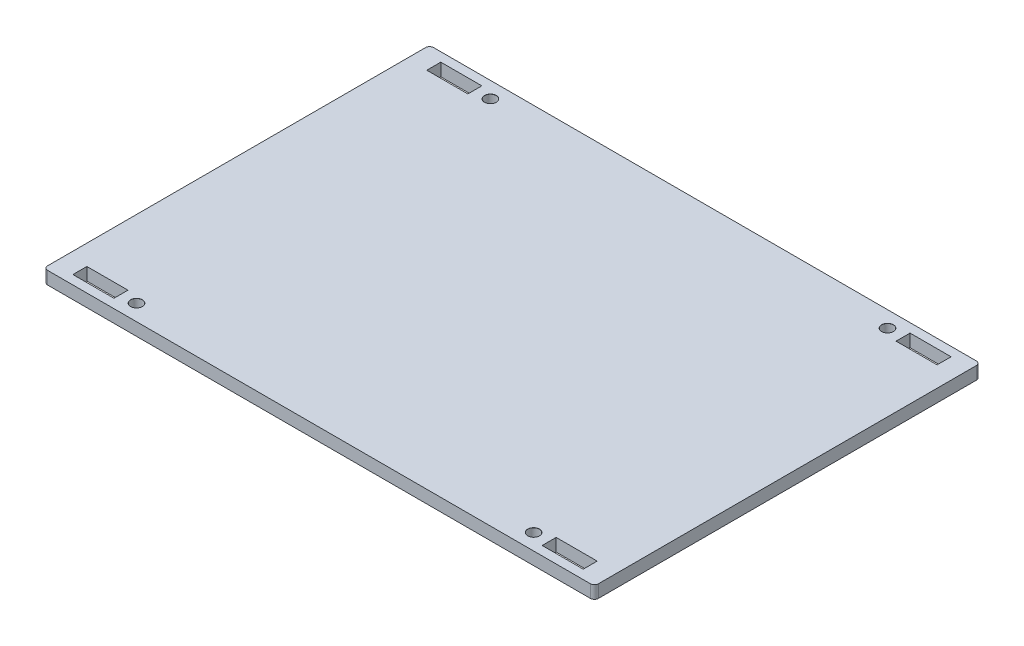
ISO-10303-21;
HEADER;
FILE_DESCRIPTION(('STEP AP214'),'2;1');
FILE_NAME('part.step','',(''),(''),'','','');
FILE_SCHEMA(('AUTOMOTIVE_DESIGN { 1 0 10303 214 1 1 1 1 }'));
ENDSEC;
DATA;
#1=APPLICATION_CONTEXT('core data for automotive mechanical design processes');
#2=APPLICATION_PROTOCOL_DEFINITION('international standard','automotive_design',2000,#1);
#3=PRODUCT_CONTEXT('',#1,'mechanical');
#4=PRODUCT('Part','Part','',(#3));
#5=PRODUCT_RELATED_PRODUCT_CATEGORY('part','',(#4));
#6=PRODUCT_DEFINITION_FORMATION('','',#4);
#7=PRODUCT_DEFINITION_CONTEXT('part definition',#1,'design');
#8=PRODUCT_DEFINITION('design','',#6,#7);
#9=PRODUCT_DEFINITION_SHAPE('','',#8);
#10=(LENGTH_UNIT() NAMED_UNIT(*) SI_UNIT(.MILLI.,.METRE.));
#11=(NAMED_UNIT(*) PLANE_ANGLE_UNIT() SI_UNIT($,.RADIAN.));
#12=(NAMED_UNIT(*) SI_UNIT($,.STERADIAN.) SOLID_ANGLE_UNIT());
#13=UNCERTAINTY_MEASURE_WITH_UNIT(LENGTH_MEASURE(1.E-05),#10,'distance_accuracy_value','');
#14=(GEOMETRIC_REPRESENTATION_CONTEXT(3) GLOBAL_UNCERTAINTY_ASSIGNED_CONTEXT((#13)) GLOBAL_UNIT_ASSIGNED_CONTEXT((#10,
#11,#12)) REPRESENTATION_CONTEXT('',''));
#15=CARTESIAN_POINT('',(0.,0.,0.));
#16=DIRECTION('',(0.,0.,1.));
#17=DIRECTION('',(1.,0.,0.));
#18=AXIS2_PLACEMENT_3D('',#15,#16,#17);
#19=CARTESIAN_POINT('',(0.,3.175,0.));
#20=DIRECTION('',(0.,1.,0.));
#21=DIRECTION('',(0.,0.,1.));
#22=AXIS2_PLACEMENT_3D('',#19,#20,#21);
#23=PLANE('',#22);
#24=CARTESIAN_POINT('',(49.57,3.175,44.1725));
#25=DIRECTION('',(0.,1.,0.));
#26=DIRECTION('',(0.,0.,1.));
#27=AXIS2_PLACEMENT_3D('',#24,#25,#26);
#28=CIRCLE('',#27,1.475);
#29=CARTESIAN_POINT('',(49.57,3.175,45.6475));
#30=VERTEX_POINT('',#29);
#31=EDGE_CURVE('E820',#30,#30,#28,.T.);
#32=ORIENTED_EDGE('',*,*,#31,.F.);
#33=EDGE_LOOP('',(#32));
#34=FACE_BOUND('',#33,.T.);
#35=CARTESIAN_POINT('',(49.57,3.175,-44.1725));
#36=DIRECTION('',(0.,1.,0.));
#37=DIRECTION('',(0.,0.,1.));
#38=AXIS2_PLACEMENT_3D('',#35,#36,#37);
#39=CIRCLE('',#38,1.475);
#40=CARTESIAN_POINT('',(49.57,3.175,-42.6975));
#41=VERTEX_POINT('',#40);
#42=EDGE_CURVE('E811',#41,#41,#39,.T.);
#43=ORIENTED_EDGE('',*,*,#42,.F.);
#44=EDGE_LOOP('',(#43));
#45=FACE_BOUND('',#44,.T.);
#46=CARTESIAN_POINT('',(-49.57,3.175,44.1725));
#47=DIRECTION('',(0.,1.,0.));
#48=DIRECTION('',(0.,0.,1.));
#49=AXIS2_PLACEMENT_3D('',#46,#47,#48);
#50=CIRCLE('',#49,1.475);
#51=CARTESIAN_POINT('',(-49.57,3.175,45.6475));
#52=VERTEX_POINT('',#51);
#53=EDGE_CURVE('E802',#52,#52,#50,.T.);
#54=ORIENTED_EDGE('',*,*,#53,.F.);
#55=EDGE_LOOP('',(#54));
#56=FACE_BOUND('',#55,.T.);
#57=DIRECTION('',(-1.,0.,0.));
#58=VECTOR('',#57,1.);
#59=CARTESIAN_POINT('',(0.,3.175,42.42625));
#60=LINE('',#59,#58);
#61=CARTESIAN_POINT('',(63.695,3.175,42.42625));
#62=VERTEX_POINT('',#61);
#63=CARTESIAN_POINT('',(53.445,3.175,42.42625));
#64=VERTEX_POINT('',#63);
#65=EDGE_CURVE('E223',#62,#64,#60,.T.);
#66=ORIENTED_EDGE('',*,*,#65,.F.);
#67=DIRECTION('',(0.,0.,1.));
#68=VECTOR('',#67,1.);
#69=CARTESIAN_POINT('',(63.695,3.175,0.));
#70=LINE('',#69,#68);
#71=CARTESIAN_POINT('',(63.695,3.175,45.91875));
#72=VERTEX_POINT('',#71);
#73=EDGE_CURVE('E227',#62,#72,#70,.T.);
#74=ORIENTED_EDGE('',*,*,#73,.T.);
#75=DIRECTION('',(-1.,0.,0.));
#76=VECTOR('',#75,1.);
#77=CARTESIAN_POINT('',(0.,3.175,45.91875));
#78=LINE('',#77,#76);
#79=CARTESIAN_POINT('',(53.445,3.175,45.91875));
#80=VERTEX_POINT('',#79);
#81=EDGE_CURVE('E207',#72,#80,#78,.T.);
#82=ORIENTED_EDGE('',*,*,#81,.T.);
#83=DIRECTION('',(0.,0.,1.));
#84=VECTOR('',#83,1.);
#85=CARTESIAN_POINT('',(53.445,3.175,0.));
#86=LINE('',#85,#84);
#87=EDGE_CURVE('E218',#64,#80,#86,.T.);
#88=ORIENTED_EDGE('',*,*,#87,.F.);
#89=EDGE_LOOP('',(#66,#74,#82,#88));
#90=FACE_BOUND('',#89,.T.);
#91=CARTESIAN_POINT('',(-49.57,3.175,-44.1725));
#92=DIRECTION('',(0.,1.,0.));
#93=DIRECTION('',(0.,0.,1.));
#94=AXIS2_PLACEMENT_3D('',#91,#92,#93);
#95=CIRCLE('',#94,1.475);
#96=CARTESIAN_POINT('',(-49.57,3.175,-42.6975));
#97=VERTEX_POINT('',#96);
#98=EDGE_CURVE('E272',#97,#97,#95,.T.);
#99=ORIENTED_EDGE('',*,*,#98,.F.);
#100=EDGE_LOOP('',(#99));
#101=FACE_BOUND('',#100,.T.);
#102=DIRECTION('',(1.,0.,0.));
#103=VECTOR('',#102,1.);
#104=CARTESIAN_POINT('',(0.,3.175,-42.42625));
#105=LINE('',#104,#103);
#106=CARTESIAN_POINT('',(-63.695,3.175,-42.42625));
#107=VERTEX_POINT('',#106);
#108=CARTESIAN_POINT('',(-53.445,3.175,-42.42625));
#109=VERTEX_POINT('',#108);
#110=EDGE_CURVE('E287',#107,#109,#105,.T.);
#111=ORIENTED_EDGE('',*,*,#110,.F.);
#112=DIRECTION('',(0.,0.,-1.));
#113=VECTOR('',#112,1.);
#114=CARTESIAN_POINT('',(-63.695,3.175,0.));
#115=LINE('',#114,#113);
#116=CARTESIAN_POINT('',(-63.695,3.175,-45.91875));
#117=VERTEX_POINT('',#116);
#118=EDGE_CURVE('E295',#107,#117,#115,.T.);
#119=ORIENTED_EDGE('',*,*,#118,.T.);
#120=DIRECTION('',(1.,0.,0.));
#121=VECTOR('',#120,1.);
#122=CARTESIAN_POINT('',(0.,3.175,-45.91875));
#123=LINE('',#122,#121);
#124=CARTESIAN_POINT('',(-53.445,3.175,-45.91875));
#125=VERTEX_POINT('',#124);
#126=EDGE_CURVE('E292',#117,#125,#123,.T.);
#127=ORIENTED_EDGE('',*,*,#126,.T.);
#128=DIRECTION('',(0.,0.,-1.));
#129=VECTOR('',#128,1.);
#130=CARTESIAN_POINT('',(-53.445,3.175,0.));
#131=LINE('',#130,#129);
#132=EDGE_CURVE('E289',#109,#125,#131,.T.);
#133=ORIENTED_EDGE('',*,*,#132,.F.);
#134=EDGE_LOOP('',(#111,#119,#127,#133));
#135=FACE_BOUND('',#134,.T.);
#136=DIRECTION('',(0.,0.,-1.));
#137=VECTOR('',#136,1.);
#138=CARTESIAN_POINT('',(68.745,3.175,0.));
#139=LINE('',#138,#137);
#140=CARTESIAN_POINT('',(68.745,3.175,47.1725));
#141=VERTEX_POINT('',#140);
#142=CARTESIAN_POINT('',(68.745,3.175,-47.1724999999999));
#143=VERTEX_POINT('',#142);
#144=EDGE_CURVE('E311',#141,#143,#139,.T.);
#145=ORIENTED_EDGE('',*,*,#144,.T.);
#146=CARTESIAN_POINT('',(67.745,3.175,-47.1724999999999));
#147=DIRECTION('',(0.,1.,0.));
#148=DIRECTION('',(0.,0.,1.));
#149=AXIS2_PLACEMENT_3D('',#146,#147,#148);
#150=CIRCLE('',#149,1.);
#151=CARTESIAN_POINT('',(67.745,3.175,-48.1724999999999));
#152=VERTEX_POINT('',#151);
#153=EDGE_CURVE('E392',#143,#152,#150,.T.);
#154=ORIENTED_EDGE('',*,*,#153,.T.);
#155=DIRECTION('',(1.,0.,0.));
#156=VECTOR('',#155,1.);
#157=CARTESIAN_POINT('',(0.,3.175,-48.1724999999999));
#158=LINE('',#157,#156);
#159=CARTESIAN_POINT('',(-67.745,3.175,-48.1724999999999));
#160=VERTEX_POINT('',#159);
#161=EDGE_CURVE('E315',#160,#152,#158,.T.);
#162=ORIENTED_EDGE('',*,*,#161,.F.);
#163=CARTESIAN_POINT('',(-67.745,3.175,-47.1724999999999));
#164=DIRECTION('',(0.,1.,0.));
#165=DIRECTION('',(0.,0.,1.));
#166=AXIS2_PLACEMENT_3D('',#163,#164,#165);
#167=CIRCLE('',#166,1.);
#168=CARTESIAN_POINT('',(-68.745,3.175,-47.1724999999999));
#169=VERTEX_POINT('',#168);
#170=EDGE_CURVE('E56',#160,#169,#167,.T.);
#171=ORIENTED_EDGE('',*,*,#170,.T.);
#172=DIRECTION('',(0.,0.,-1.));
#173=VECTOR('',#172,1.);
#174=CARTESIAN_POINT('',(-68.745,3.175,0.));
#175=LINE('',#174,#173);
#176=CARTESIAN_POINT('',(-68.745,3.175,47.1725));
#177=VERTEX_POINT('',#176);
#178=EDGE_CURVE('E318',#177,#169,#175,.T.);
#179=ORIENTED_EDGE('',*,*,#178,.F.);
#180=CARTESIAN_POINT('',(-67.745,3.175,47.1725));
#181=DIRECTION('',(0.,1.,0.));
#182=DIRECTION('',(0.,0.,1.));
#183=AXIS2_PLACEMENT_3D('',#180,#181,#182);
#184=CIRCLE('',#183,1.);
#185=CARTESIAN_POINT('',(-67.745,3.175,48.1725));
#186=VERTEX_POINT('',#185);
#187=EDGE_CURVE('E388',#177,#186,#184,.T.);
#188=ORIENTED_EDGE('',*,*,#187,.T.);
#189=DIRECTION('',(1.,0.,0.));
#190=VECTOR('',#189,1.);
#191=CARTESIAN_POINT('',(0.,3.175,48.1725));
#192=LINE('',#191,#190);
#193=CARTESIAN_POINT('',(67.745,3.175,48.1725));
#194=VERTEX_POINT('',#193);
#195=EDGE_CURVE('E308',#186,#194,#192,.T.);
#196=ORIENTED_EDGE('',*,*,#195,.T.);
#197=CARTESIAN_POINT('',(67.745,3.175,47.1725));
#198=DIRECTION('',(0.,1.,0.));
#199=DIRECTION('',(0.,0.,1.));
#200=AXIS2_PLACEMENT_3D('',#197,#198,#199);
#201=CIRCLE('',#200,1.);
#202=EDGE_CURVE('E390',#194,#141,#201,.T.);
#203=ORIENTED_EDGE('',*,*,#202,.T.);
#204=EDGE_LOOP('',(#145,#154,#162,#171,#179,#188,#196,#203));
#205=FACE_BOUND('',#204,.T.);
#206=DIRECTION('',(0.,0.,1.));
#207=VECTOR('',#206,1.);
#208=CARTESIAN_POINT('',(-63.695,3.175,0.));
#209=LINE('',#208,#207);
#210=CARTESIAN_POINT('',(-63.695,3.175,42.42625));
#211=VERTEX_POINT('',#210);
#212=CARTESIAN_POINT('',(-63.695,3.175,45.91875));
#213=VERTEX_POINT('',#212);
#214=EDGE_CURVE('E260',#211,#213,#209,.T.);
#215=ORIENTED_EDGE('',*,*,#214,.F.);
#216=DIRECTION('',(1.,0.,0.));
#217=VECTOR('',#216,1.);
#218=CARTESIAN_POINT('',(0.,3.175,42.42625));
#219=LINE('',#218,#217);
#220=CARTESIAN_POINT('',(-53.445,3.175,42.42625));
#221=VERTEX_POINT('',#220);
#222=EDGE_CURVE('E251',#211,#221,#219,.T.);
#223=ORIENTED_EDGE('',*,*,#222,.T.);
#224=DIRECTION('',(0.,0.,1.));
#225=VECTOR('',#224,1.);
#226=CARTESIAN_POINT('',(-53.445,3.175,0.));
#227=LINE('',#226,#225);
#228=CARTESIAN_POINT('',(-53.445,3.175,45.91875));
#229=VERTEX_POINT('',#228);
#230=EDGE_CURVE('E266',#221,#229,#227,.T.);
#231=ORIENTED_EDGE('',*,*,#230,.T.);
#232=DIRECTION('',(1.,0.,0.));
#233=VECTOR('',#232,1.);
#234=CARTESIAN_POINT('',(0.,3.175,45.91875));
#235=LINE('',#234,#233);
#236=EDGE_CURVE('E263',#213,#229,#235,.T.);
#237=ORIENTED_EDGE('',*,*,#236,.F.);
#238=EDGE_LOOP('',(#215,#223,#231,#237));
#239=FACE_BOUND('',#238,.T.);
#240=DIRECTION('',(0.,0.,-1.));
#241=VECTOR('',#240,1.);
#242=CARTESIAN_POINT('',(63.695,3.175,0.));
#243=LINE('',#242,#241);
#244=CARTESIAN_POINT('',(63.695,3.175,-42.42625));
#245=VERTEX_POINT('',#244);
#246=CARTESIAN_POINT('',(63.695,3.175,-45.91875));
#247=VERTEX_POINT('',#246);
#248=EDGE_CURVE('E239',#245,#247,#243,.T.);
#249=ORIENTED_EDGE('',*,*,#248,.F.);
#250=DIRECTION('',(-1.,0.,0.));
#251=VECTOR('',#250,1.);
#252=CARTESIAN_POINT('',(0.,3.175,-42.42625));
#253=LINE('',#252,#251);
#254=CARTESIAN_POINT('',(53.445,3.175,-42.42625));
#255=VERTEX_POINT('',#254);
#256=EDGE_CURVE('E234',#245,#255,#253,.T.);
#257=ORIENTED_EDGE('',*,*,#256,.T.);
#258=DIRECTION('',(0.,0.,-1.));
#259=VECTOR('',#258,1.);
#260=CARTESIAN_POINT('',(53.445,3.175,0.));
#261=LINE('',#260,#259);
#262=CARTESIAN_POINT('',(53.445,3.175,-45.91875));
#263=VERTEX_POINT('',#262);
#264=EDGE_CURVE('E245',#255,#263,#261,.T.);
#265=ORIENTED_EDGE('',*,*,#264,.T.);
#266=DIRECTION('',(-1.,0.,0.));
#267=VECTOR('',#266,1.);
#268=CARTESIAN_POINT('',(0.,3.175,-45.91875));
#269=LINE('',#268,#267);
#270=EDGE_CURVE('E242',#247,#263,#269,.T.);
#271=ORIENTED_EDGE('',*,*,#270,.F.);
#272=EDGE_LOOP('',(#249,#257,#265,#271));
#273=FACE_BOUND('',#272,.T.);
#274=ADVANCED_FACE('F41',(#34,#45,#56,#90,#101,#135,#205,#239,#273),#23,.T.);
#275=CARTESIAN_POINT('',(0.,0.,0.));
#276=DIRECTION('',(0.,1.,0.));
#277=DIRECTION('',(0.,0.,1.));
#278=AXIS2_PLACEMENT_3D('',#275,#276,#277);
#279=PLANE('',#278);
#280=CARTESIAN_POINT('',(49.57,0.,44.1725));
#281=DIRECTION('',(0.,1.,0.));
#282=DIRECTION('',(0.,0.,1.));
#283=AXIS2_PLACEMENT_3D('',#280,#281,#282);
#284=CIRCLE('',#283,1.45);
#285=CARTESIAN_POINT('',(49.57,0.,45.6225));
#286=VERTEX_POINT('',#285);
#287=EDGE_CURVE('E814',#286,#286,#284,.T.);
#288=ORIENTED_EDGE('',*,*,#287,.T.);
#289=EDGE_LOOP('',(#288));
#290=FACE_BOUND('',#289,.T.);
#291=CARTESIAN_POINT('',(49.57,0.,-44.1725));
#292=DIRECTION('',(0.,1.,0.));
#293=DIRECTION('',(0.,0.,1.));
#294=AXIS2_PLACEMENT_3D('',#291,#292,#293);
#295=CIRCLE('',#294,1.45);
#296=CARTESIAN_POINT('',(49.57,0.,-42.7225));
#297=VERTEX_POINT('',#296);
#298=EDGE_CURVE('E805',#297,#297,#295,.T.);
#299=ORIENTED_EDGE('',*,*,#298,.T.);
#300=EDGE_LOOP('',(#299));
#301=FACE_BOUND('',#300,.T.);
#302=CARTESIAN_POINT('',(-49.57,0.,44.1725));
#303=DIRECTION('',(0.,1.,0.));
#304=DIRECTION('',(0.,0.,1.));
#305=AXIS2_PLACEMENT_3D('',#302,#303,#304);
#306=CIRCLE('',#305,1.45);
#307=CARTESIAN_POINT('',(-49.57,0.,45.6225));
#308=VERTEX_POINT('',#307);
#309=EDGE_CURVE('E795',#308,#308,#306,.T.);
#310=ORIENTED_EDGE('',*,*,#309,.T.);
#311=EDGE_LOOP('',(#310));
#312=FACE_BOUND('',#311,.T.);
#313=DIRECTION('',(0.,0.,1.));
#314=VECTOR('',#313,1.);
#315=CARTESIAN_POINT('',(63.695,0.,0.));
#316=LINE('',#315,#314);
#317=CARTESIAN_POINT('',(63.695,0.,42.42625));
#318=VERTEX_POINT('',#317);
#319=CARTESIAN_POINT('',(63.695,0.,45.91875));
#320=VERTEX_POINT('',#319);
#321=EDGE_CURVE('E364',#318,#320,#316,.T.);
#322=ORIENTED_EDGE('',*,*,#321,.F.);
#323=DIRECTION('',(-1.,0.,0.));
#324=VECTOR('',#323,1.);
#325=CARTESIAN_POINT('',(0.,0.,42.42625));
#326=LINE('',#325,#324);
#327=CARTESIAN_POINT('',(53.445,0.,42.42625));
#328=VERTEX_POINT('',#327);
#329=EDGE_CURVE('E366',#318,#328,#326,.T.);
#330=ORIENTED_EDGE('',*,*,#329,.T.);
#331=DIRECTION('',(0.,0.,1.));
#332=VECTOR('',#331,1.);
#333=CARTESIAN_POINT('',(53.445,0.,0.));
#334=LINE('',#333,#332);
#335=CARTESIAN_POINT('',(53.445,0.,45.91875));
#336=VERTEX_POINT('',#335);
#337=EDGE_CURVE('E361',#328,#336,#334,.T.);
#338=ORIENTED_EDGE('',*,*,#337,.T.);
#339=DIRECTION('',(-1.,0.,0.));
#340=VECTOR('',#339,1.);
#341=CARTESIAN_POINT('',(0.,0.,45.91875));
#342=LINE('',#341,#340);
#343=EDGE_CURVE('E210',#320,#336,#342,.T.);
#344=ORIENTED_EDGE('',*,*,#343,.F.);
#345=EDGE_LOOP('',(#322,#330,#338,#344));
#346=FACE_BOUND('',#345,.T.);
#347=DIRECTION('',(1.,0.,0.));
#348=VECTOR('',#347,1.);
#349=CARTESIAN_POINT('',(0.,0.,42.42625));
#350=LINE('',#349,#348);
#351=CARTESIAN_POINT('',(-63.695,0.,42.42625));
#352=VERTEX_POINT('',#351);
#353=CARTESIAN_POINT('',(-53.445,0.,42.42625));
#354=VERTEX_POINT('',#353);
#355=EDGE_CURVE('E349',#352,#354,#350,.T.);
#356=ORIENTED_EDGE('',*,*,#355,.F.);
#357=DIRECTION('',(0.,0.,1.));
#358=VECTOR('',#357,1.);
#359=CARTESIAN_POINT('',(-63.695,0.,0.));
#360=LINE('',#359,#358);
#361=CARTESIAN_POINT('',(-63.695,0.,45.91875));
#362=VERTEX_POINT('',#361);
#363=EDGE_CURVE('E341',#352,#362,#360,.T.);
#364=ORIENTED_EDGE('',*,*,#363,.T.);
#365=DIRECTION('',(1.,0.,0.));
#366=VECTOR('',#365,1.);
#367=CARTESIAN_POINT('',(0.,0.,45.91875));
#368=LINE('',#367,#366);
#369=CARTESIAN_POINT('',(-53.445,0.,45.91875));
#370=VERTEX_POINT('',#369);
#371=EDGE_CURVE('E344',#362,#370,#368,.T.);
#372=ORIENTED_EDGE('',*,*,#371,.T.);
#373=DIRECTION('',(0.,0.,1.));
#374=VECTOR('',#373,1.);
#375=CARTESIAN_POINT('',(-53.445,0.,0.));
#376=LINE('',#375,#374);
#377=EDGE_CURVE('E347',#354,#370,#376,.T.);
#378=ORIENTED_EDGE('',*,*,#377,.F.);
#379=EDGE_LOOP('',(#356,#364,#372,#378));
#380=FACE_BOUND('',#379,.T.);
#381=CARTESIAN_POINT('',(-49.57,0.,-44.1725));
#382=DIRECTION('',(0.,1.,0.));
#383=DIRECTION('',(0.,0.,1.));
#384=AXIS2_PLACEMENT_3D('',#381,#382,#383);
#385=CIRCLE('',#384,1.45);
#386=CARTESIAN_POINT('',(-49.57,0.,-42.7225));
#387=VERTEX_POINT('',#386);
#388=EDGE_CURVE('E284',#387,#387,#385,.T.);
#389=ORIENTED_EDGE('',*,*,#388,.T.);
#390=EDGE_LOOP('',(#389));
#391=FACE_BOUND('',#390,.T.);
#392=DIRECTION('',(0.,0.,-1.));
#393=VECTOR('',#392,1.);
#394=CARTESIAN_POINT('',(-63.695,0.,0.));
#395=LINE('',#394,#393);
#396=CARTESIAN_POINT('',(-63.695,0.,-42.42625));
#397=VERTEX_POINT('',#396);
#398=CARTESIAN_POINT('',(-63.695,0.,-45.91875));
#399=VERTEX_POINT('',#398);
#400=EDGE_CURVE('E336',#397,#399,#395,.T.);
#401=ORIENTED_EDGE('',*,*,#400,.F.);
#402=DIRECTION('',(1.,0.,0.));
#403=VECTOR('',#402,1.);
#404=CARTESIAN_POINT('',(0.,0.,-42.42625));
#405=LINE('',#404,#403);
#406=CARTESIAN_POINT('',(-53.445,0.,-42.42625));
#407=VERTEX_POINT('',#406);
#408=EDGE_CURVE('E338',#397,#407,#405,.T.);
#409=ORIENTED_EDGE('',*,*,#408,.T.);
#410=DIRECTION('',(0.,0.,-1.));
#411=VECTOR('',#410,1.);
#412=CARTESIAN_POINT('',(-53.445,0.,0.));
#413=LINE('',#412,#411);
#414=CARTESIAN_POINT('',(-53.445,0.,-45.91875));
#415=VERTEX_POINT('',#414);
#416=EDGE_CURVE('E320',#407,#415,#413,.T.);
#417=ORIENTED_EDGE('',*,*,#416,.T.);
#418=DIRECTION('',(1.,0.,0.));
#419=VECTOR('',#418,1.);
#420=CARTESIAN_POINT('',(0.,0.,-45.91875));
#421=LINE('',#420,#419);
#422=EDGE_CURVE('E333',#399,#415,#421,.T.);
#423=ORIENTED_EDGE('',*,*,#422,.F.);
#424=EDGE_LOOP('',(#401,#409,#417,#423));
#425=FACE_BOUND('',#424,.T.);
#426=DIRECTION('',(1.,0.,0.));
#427=VECTOR('',#426,1.);
#428=CARTESIAN_POINT('',(0.,0.,-48.1724999999999));
#429=LINE('',#428,#427);
#430=CARTESIAN_POINT('',(-67.745,0.,-48.1724999999999));
#431=VERTEX_POINT('',#430);
#432=CARTESIAN_POINT('',(67.745,0.,-48.1724999999999));
#433=VERTEX_POINT('',#432);
#434=EDGE_CURVE('E326',#431,#433,#429,.T.);
#435=ORIENTED_EDGE('',*,*,#434,.T.);
#436=CARTESIAN_POINT('',(67.745,0.,-47.1724999999999));
#437=DIRECTION('',(0.,1.,0.));
#438=DIRECTION('',(0.,0.,1.));
#439=AXIS2_PLACEMENT_3D('',#436,#437,#438);
#440=CIRCLE('',#439,1.);
#441=CARTESIAN_POINT('',(68.745,0.,-47.1724999999999));
#442=VERTEX_POINT('',#441);
#443=EDGE_CURVE('E380',#433,#442,#440,.F.);
#444=ORIENTED_EDGE('',*,*,#443,.T.);
#445=DIRECTION('',(0.,0.,-1.));
#446=VECTOR('',#445,1.);
#447=CARTESIAN_POINT('',(68.745,0.,0.));
#448=LINE('',#447,#446);
#449=CARTESIAN_POINT('',(68.745,0.,47.1725));
#450=VERTEX_POINT('',#449);
#451=EDGE_CURVE('E323',#450,#442,#448,.T.);
#452=ORIENTED_EDGE('',*,*,#451,.F.);
#453=CARTESIAN_POINT('',(67.745,0.,47.1725));
#454=DIRECTION('',(0.,1.,0.));
#455=DIRECTION('',(0.,0.,1.));
#456=AXIS2_PLACEMENT_3D('',#453,#454,#455);
#457=CIRCLE('',#456,1.);
#458=CARTESIAN_POINT('',(67.745,0.,48.1725));
#459=VERTEX_POINT('',#458);
#460=EDGE_CURVE('E378',#450,#459,#457,.F.);
#461=ORIENTED_EDGE('',*,*,#460,.T.);
#462=DIRECTION('',(1.,0.,0.));
#463=VECTOR('',#462,1.);
#464=CARTESIAN_POINT('',(0.,0.,48.1725));
#465=LINE('',#464,#463);
#466=CARTESIAN_POINT('',(-67.745,0.,48.1725));
#467=VERTEX_POINT('',#466);
#468=EDGE_CURVE('E301',#467,#459,#465,.T.);
#469=ORIENTED_EDGE('',*,*,#468,.F.);
#470=CARTESIAN_POINT('',(-67.745,0.,47.1725));
#471=DIRECTION('',(0.,1.,0.));
#472=DIRECTION('',(0.,0.,1.));
#473=AXIS2_PLACEMENT_3D('',#470,#471,#472);
#474=CIRCLE('',#473,1.);
#475=CARTESIAN_POINT('',(-68.745,0.,47.1725));
#476=VERTEX_POINT('',#475);
#477=EDGE_CURVE('E376',#467,#476,#474,.F.);
#478=ORIENTED_EDGE('',*,*,#477,.T.);
#479=DIRECTION('',(0.,0.,-1.));
#480=VECTOR('',#479,1.);
#481=CARTESIAN_POINT('',(-68.745,0.,0.));
#482=LINE('',#481,#480);
#483=CARTESIAN_POINT('',(-68.745,0.,-47.1724999999999));
#484=VERTEX_POINT('',#483);
#485=EDGE_CURVE('E312',#476,#484,#482,.T.);
#486=ORIENTED_EDGE('',*,*,#485,.T.);
#487=CARTESIAN_POINT('',(-67.745,0.,-47.1724999999999));
#488=DIRECTION('',(0.,1.,0.));
#489=DIRECTION('',(0.,0.,1.));
#490=AXIS2_PLACEMENT_3D('',#487,#488,#489);
#491=CIRCLE('',#490,1.);
#492=EDGE_CURVE('E374',#484,#431,#491,.F.);
#493=ORIENTED_EDGE('',*,*,#492,.T.);
#494=EDGE_LOOP('',(#435,#444,#452,#461,#469,#478,#486,#493));
#495=FACE_BOUND('',#494,.T.);
#496=DIRECTION('',(-1.,0.,0.));
#497=VECTOR('',#496,1.);
#498=CARTESIAN_POINT('',(0.,0.,-42.42625));
#499=LINE('',#498,#497);
#500=CARTESIAN_POINT('',(63.695,0.,-42.42625));
#501=VERTEX_POINT('',#500);
#502=CARTESIAN_POINT('',(53.445,0.,-42.42625));
#503=VERTEX_POINT('',#502);
#504=EDGE_CURVE('E359',#501,#503,#499,.T.);
#505=ORIENTED_EDGE('',*,*,#504,.F.);
#506=DIRECTION('',(0.,0.,-1.));
#507=VECTOR('',#506,1.);
#508=CARTESIAN_POINT('',(63.695,0.,0.));
#509=LINE('',#508,#507);
#510=CARTESIAN_POINT('',(63.695,0.,-45.91875));
#511=VERTEX_POINT('',#510);
#512=EDGE_CURVE('E351',#501,#511,#509,.T.);
#513=ORIENTED_EDGE('',*,*,#512,.T.);
#514=DIRECTION('',(-1.,0.,0.));
#515=VECTOR('',#514,1.);
#516=CARTESIAN_POINT('',(0.,0.,-45.91875));
#517=LINE('',#516,#515);
#518=CARTESIAN_POINT('',(53.445,0.,-45.91875));
#519=VERTEX_POINT('',#518);
#520=EDGE_CURVE('E354',#511,#519,#517,.T.);
#521=ORIENTED_EDGE('',*,*,#520,.T.);
#522=DIRECTION('',(0.,0.,-1.));
#523=VECTOR('',#522,1.);
#524=CARTESIAN_POINT('',(53.445,0.,0.));
#525=LINE('',#524,#523);
#526=EDGE_CURVE('E357',#503,#519,#525,.T.);
#527=ORIENTED_EDGE('',*,*,#526,.F.);
#528=EDGE_LOOP('',(#505,#513,#521,#527));
#529=FACE_BOUND('',#528,.T.);
#530=ADVANCED_FACE('F403',(#290,#301,#312,#346,#380,#391,#425,#495,#529),#279,.F.);
#531=CARTESIAN_POINT('',(0.,3.175,48.1725));
#532=DIRECTION('',(0.,0.,-1.));
#533=DIRECTION('',(-1.,0.,0.));
#534=AXIS2_PLACEMENT_3D('',#531,#532,#533);
#535=PLANE('',#534);
#536=ORIENTED_EDGE('',*,*,#468,.T.);
#537=DIRECTION('',(0.,-1.,0.));
#538=VECTOR('',#537,1.);
#539=CARTESIAN_POINT('',(67.745,3.175,48.1725));
#540=LINE('',#539,#538);
#541=EDGE_CURVE('E397',#459,#194,#540,.F.);
#542=ORIENTED_EDGE('',*,*,#541,.T.);
#543=ORIENTED_EDGE('',*,*,#195,.F.);
#544=DIRECTION('',(0.,-1.,0.));
#545=VECTOR('',#544,1.);
#546=CARTESIAN_POINT('',(-67.745,0.,48.1725));
#547=LINE('',#546,#545);
#548=EDGE_CURVE('E394',#186,#467,#547,.T.);
#549=ORIENTED_EDGE('',*,*,#548,.T.);
#550=EDGE_LOOP('',(#536,#542,#543,#549));
#551=FACE_BOUND('',#550,.T.);
#552=ADVANCED_FACE('F413',(#551),#535,.F.);
#553=CARTESIAN_POINT('',(68.745,3.175,0.));
#554=DIRECTION('',(-1.,0.,0.));
#555=DIRECTION('',(0.,0.,1.));
#556=AXIS2_PLACEMENT_3D('',#553,#554,#555);
#557=PLANE('',#556);
#558=ORIENTED_EDGE('',*,*,#451,.T.);
#559=DIRECTION('',(0.,-1.,0.));
#560=VECTOR('',#559,1.);
#561=CARTESIAN_POINT('',(68.745,3.175,-47.1724999999999));
#562=LINE('',#561,#560);
#563=EDGE_CURVE('E385',#442,#143,#562,.F.);
#564=ORIENTED_EDGE('',*,*,#563,.T.);
#565=ORIENTED_EDGE('',*,*,#144,.F.);
#566=DIRECTION('',(0.,-1.,0.));
#567=VECTOR('',#566,1.);
#568=CARTESIAN_POINT('',(68.745,3.175,47.1725));
#569=LINE('',#568,#567);
#570=EDGE_CURVE('E382',#141,#450,#569,.T.);
#571=ORIENTED_EDGE('',*,*,#570,.T.);
#572=EDGE_LOOP('',(#558,#564,#565,#571));
#573=FACE_BOUND('',#572,.T.);
#574=ADVANCED_FACE('F423',(#573),#557,.F.);
#575=CARTESIAN_POINT('',(0.,3.175,-48.1724999999999));
#576=DIRECTION('',(0.,0.,-1.));
#577=DIRECTION('',(-1.,0.,0.));
#578=AXIS2_PLACEMENT_3D('',#575,#576,#577);
#579=PLANE('',#578);
#580=ORIENTED_EDGE('',*,*,#161,.T.);
#581=DIRECTION('',(0.,-1.,0.));
#582=VECTOR('',#581,1.);
#583=CARTESIAN_POINT('',(67.745,0.,-48.1724999999999));
#584=LINE('',#583,#582);
#585=EDGE_CURVE('E371',#152,#433,#584,.T.);
#586=ORIENTED_EDGE('',*,*,#585,.T.);
#587=ORIENTED_EDGE('',*,*,#434,.F.);
#588=DIRECTION('',(0.,-1.,0.));
#589=VECTOR('',#588,1.);
#590=CARTESIAN_POINT('',(-67.745,3.175,-48.1724999999999));
#591=LINE('',#590,#589);
#592=EDGE_CURVE('E369',#431,#160,#591,.F.);
#593=ORIENTED_EDGE('',*,*,#592,.T.);
#594=EDGE_LOOP('',(#580,#586,#587,#593));
#595=FACE_BOUND('',#594,.T.);
#596=ADVANCED_FACE('F430',(#595),#579,.T.);
#597=CARTESIAN_POINT('',(-68.745,3.175,0.));
#598=DIRECTION('',(-1.,0.,0.));
#599=DIRECTION('',(0.,0.,1.));
#600=AXIS2_PLACEMENT_3D('',#597,#598,#599);
#601=PLANE('',#600);
#602=ORIENTED_EDGE('',*,*,#485,.F.);
#603=DIRECTION('',(0.,-1.,0.));
#604=VECTOR('',#603,1.);
#605=CARTESIAN_POINT('',(-68.745,3.175,47.1725));
#606=LINE('',#605,#604);
#607=EDGE_CURVE('E11',#476,#177,#606,.F.);
#608=ORIENTED_EDGE('',*,*,#607,.T.);
#609=ORIENTED_EDGE('',*,*,#178,.T.);
#610=DIRECTION('',(0.,-1.,0.));
#611=VECTOR('',#610,1.);
#612=CARTESIAN_POINT('',(-68.745,3.175,-47.1724999999999));
#613=LINE('',#612,#611);
#614=EDGE_CURVE('E49',#169,#484,#613,.T.);
#615=ORIENTED_EDGE('',*,*,#614,.T.);
#616=EDGE_LOOP('',(#602,#608,#609,#615));
#617=FACE_BOUND('',#616,.T.);
#618=ADVANCED_FACE('F400',(#617),#601,.T.);
#619=CARTESIAN_POINT('',(0.,-1.2E-05,-42.42625));
#620=DIRECTION('',(0.,0.,1.));
#621=DIRECTION('',(1.,0.,0.));
#622=AXIS2_PLACEMENT_3D('',#619,#620,#621);
#623=PLANE('',#622);
#624=DIRECTION('',(0.,1.,0.));
#625=VECTOR('',#624,1.);
#626=CARTESIAN_POINT('',(-63.695,-1.2E-05,-42.42625));
#627=LINE('',#626,#625);
#628=EDGE_CURVE('E299',#397,#107,#627,.T.);
#629=ORIENTED_EDGE('',*,*,#628,.T.);
#630=ORIENTED_EDGE('',*,*,#110,.T.);
#631=DIRECTION('',(0.,1.,0.));
#632=VECTOR('',#631,1.);
#633=CARTESIAN_POINT('',(-53.445,-1.2E-05,-42.42625));
#634=LINE('',#633,#632);
#635=EDGE_CURVE('E298',#407,#109,#634,.T.);
#636=ORIENTED_EDGE('',*,*,#635,.F.);
#637=ORIENTED_EDGE('',*,*,#408,.F.);
#638=EDGE_LOOP('',(#629,#630,#636,#637));
#639=FACE_BOUND('',#638,.T.);
#640=ADVANCED_FACE('F448',(#639),#623,.F.);
#641=CARTESIAN_POINT('',(-63.695,-1.2E-05,0.));
#642=DIRECTION('',(1.,0.,0.));
#643=DIRECTION('',(0.,0.,-1.));
#644=AXIS2_PLACEMENT_3D('',#641,#642,#643);
#645=PLANE('',#644);
#646=ORIENTED_EDGE('',*,*,#400,.T.);
#647=DIRECTION('',(0.,1.,0.));
#648=VECTOR('',#647,1.);
#649=CARTESIAN_POINT('',(-63.695,-1.2E-05,-45.91875));
#650=LINE('',#649,#648);
#651=EDGE_CURVE('E302',#399,#117,#650,.T.);
#652=ORIENTED_EDGE('',*,*,#651,.T.);
#653=ORIENTED_EDGE('',*,*,#118,.F.);
#654=ORIENTED_EDGE('',*,*,#628,.F.);
#655=EDGE_LOOP('',(#646,#652,#653,#654));
#656=FACE_BOUND('',#655,.T.);
#657=ADVANCED_FACE('F682',(#656),#645,.T.);
#658=CARTESIAN_POINT('',(0.,-1.2E-05,-45.91875));
#659=DIRECTION('',(0.,0.,1.));
#660=DIRECTION('',(1.,0.,0.));
#661=AXIS2_PLACEMENT_3D('',#658,#659,#660);
#662=PLANE('',#661);
#663=ORIENTED_EDGE('',*,*,#422,.T.);
#664=DIRECTION('',(0.,1.,0.));
#665=VECTOR('',#664,1.);
#666=CARTESIAN_POINT('',(-53.445,-1.2E-05,-45.91875));
#667=LINE('',#666,#665);
#668=EDGE_CURVE('E304',#415,#125,#667,.T.);
#669=ORIENTED_EDGE('',*,*,#668,.T.);
#670=ORIENTED_EDGE('',*,*,#126,.F.);
#671=ORIENTED_EDGE('',*,*,#651,.F.);
#672=EDGE_LOOP('',(#663,#669,#670,#671));
#673=FACE_BOUND('',#672,.T.);
#674=ADVANCED_FACE('F674',(#673),#662,.T.);
#675=CARTESIAN_POINT('',(-53.445,-1.2E-05,0.));
#676=DIRECTION('',(1.,0.,0.));
#677=DIRECTION('',(0.,0.,-1.));
#678=AXIS2_PLACEMENT_3D('',#675,#676,#677);
#679=PLANE('',#678);
#680=ORIENTED_EDGE('',*,*,#635,.T.);
#681=ORIENTED_EDGE('',*,*,#132,.T.);
#682=ORIENTED_EDGE('',*,*,#668,.F.);
#683=ORIENTED_EDGE('',*,*,#416,.F.);
#684=EDGE_LOOP('',(#680,#681,#682,#683));
#685=FACE_BOUND('',#684,.T.);
#686=ADVANCED_FACE('F665',(#685),#679,.F.);
#687=CARTESIAN_POINT('',(-49.57,3.175,-44.1725));
#688=DIRECTION('',(0.,1.,0.));
#689=DIRECTION('',(0.,0.,1.));
#690=AXIS2_PLACEMENT_3D('',#687,#688,#689);
#691=CYLINDRICAL_SURFACE('',#690,1.45);
#692=ORIENTED_EDGE('',*,*,#388,.F.);
#693=EDGE_LOOP('',(#692));
#694=FACE_BOUND('',#693,.T.);
#695=CARTESIAN_POINT('',(-49.57,3.15402250922057,-44.1725));
#696=DIRECTION('',(0.,1.,0.));
#697=DIRECTION('',(0.,0.,1.));
#698=AXIS2_PLACEMENT_3D('',#695,#696,#697);
#699=CIRCLE('',#698,1.45);
#700=CARTESIAN_POINT('',(-49.57,3.15402250922057,-42.7225));
#701=VERTEX_POINT('',#700);
#702=EDGE_CURVE('E281',#701,#701,#699,.T.);
#703=ORIENTED_EDGE('',*,*,#702,.T.);
#704=EDGE_LOOP('',(#703));
#705=FACE_BOUND('',#704,.T.);
#706=ADVANCED_FACE('F656',(#694,#705),#691,.F.);
#707=CARTESIAN_POINT('',(-49.57,3.175,-44.1725));
#708=DIRECTION('',(0.,1.,0.));
#709=DIRECTION('',(0.,0.,1.));
#710=AXIS2_PLACEMENT_3D('',#707,#708,#709);
#711=CONICAL_SURFACE('',#710,1.475,0.87266462599705);
#712=ORIENTED_EDGE('',*,*,#702,.F.);
#713=EDGE_LOOP('',(#712));
#714=FACE_BOUND('',#713,.T.);
#715=ORIENTED_EDGE('',*,*,#98,.T.);
#716=EDGE_LOOP('',(#715));
#717=FACE_BOUND('',#716,.T.);
#718=ADVANCED_FACE('F638',(#714,#717),#711,.F.);
#719=CARTESIAN_POINT('',(0.,-1.2E-05,42.42625));
#720=DIRECTION('',(0.,0.,1.));
#721=DIRECTION('',(1.,0.,0.));
#722=AXIS2_PLACEMENT_3D('',#719,#720,#721);
#723=PLANE('',#722);
#724=ORIENTED_EDGE('',*,*,#355,.T.);
#725=DIRECTION('',(0.,1.,0.));
#726=VECTOR('',#725,1.);
#727=CARTESIAN_POINT('',(-53.445,-1.2E-05,42.42625));
#728=LINE('',#727,#726);
#729=EDGE_CURVE('E270',#354,#221,#728,.T.);
#730=ORIENTED_EDGE('',*,*,#729,.T.);
#731=ORIENTED_EDGE('',*,*,#222,.F.);
#732=DIRECTION('',(0.,1.,0.));
#733=VECTOR('',#732,1.);
#734=CARTESIAN_POINT('',(-63.695,-1.2E-05,42.42625));
#735=LINE('',#734,#733);
#736=EDGE_CURVE('E269',#352,#211,#735,.T.);
#737=ORIENTED_EDGE('',*,*,#736,.F.);
#738=EDGE_LOOP('',(#724,#730,#731,#737));
#739=FACE_BOUND('',#738,.T.);
#740=ADVANCED_FACE('F629',(#739),#723,.T.);
#741=CARTESIAN_POINT('',(-53.445,-1.2E-05,0.));
#742=DIRECTION('',(-1.,0.,0.));
#743=DIRECTION('',(0.,0.,1.));
#744=AXIS2_PLACEMENT_3D('',#741,#742,#743);
#745=PLANE('',#744);
#746=ORIENTED_EDGE('',*,*,#377,.T.);
#747=DIRECTION('',(0.,1.,0.));
#748=VECTOR('',#747,1.);
#749=CARTESIAN_POINT('',(-53.445,-1.2E-05,45.91875));
#750=LINE('',#749,#748);
#751=EDGE_CURVE('E273',#370,#229,#750,.T.);
#752=ORIENTED_EDGE('',*,*,#751,.T.);
#753=ORIENTED_EDGE('',*,*,#230,.F.);
#754=ORIENTED_EDGE('',*,*,#729,.F.);
#755=EDGE_LOOP('',(#746,#752,#753,#754));
#756=FACE_BOUND('',#755,.T.);
#757=ADVANCED_FACE('F620',(#756),#745,.T.);
#758=CARTESIAN_POINT('',(0.,-1.2E-05,45.91875));
#759=DIRECTION('',(0.,0.,1.));
#760=DIRECTION('',(1.,0.,0.));
#761=AXIS2_PLACEMENT_3D('',#758,#759,#760);
#762=PLANE('',#761);
#763=DIRECTION('',(0.,1.,0.));
#764=VECTOR('',#763,1.);
#765=CARTESIAN_POINT('',(-63.695,-1.2E-05,45.91875));
#766=LINE('',#765,#764);
#767=EDGE_CURVE('E275',#362,#213,#766,.T.);
#768=ORIENTED_EDGE('',*,*,#767,.T.);
#769=ORIENTED_EDGE('',*,*,#236,.T.);
#770=ORIENTED_EDGE('',*,*,#751,.F.);
#771=ORIENTED_EDGE('',*,*,#371,.F.);
#772=EDGE_LOOP('',(#768,#769,#770,#771));
#773=FACE_BOUND('',#772,.T.);
#774=ADVANCED_FACE('F611',(#773),#762,.F.);
#775=CARTESIAN_POINT('',(-63.695,-1.2E-05,0.));
#776=DIRECTION('',(-1.,0.,0.));
#777=DIRECTION('',(0.,0.,1.));
#778=AXIS2_PLACEMENT_3D('',#775,#776,#777);
#779=PLANE('',#778);
#780=ORIENTED_EDGE('',*,*,#736,.T.);
#781=ORIENTED_EDGE('',*,*,#214,.T.);
#782=ORIENTED_EDGE('',*,*,#767,.F.);
#783=ORIENTED_EDGE('',*,*,#363,.F.);
#784=EDGE_LOOP('',(#780,#781,#782,#783));
#785=FACE_BOUND('',#784,.T.);
#786=ADVANCED_FACE('F602',(#785),#779,.F.);
#787=CARTESIAN_POINT('',(0.,-1.2E-05,-42.42625));
#788=DIRECTION('',(0.,0.,-1.));
#789=DIRECTION('',(-1.,0.,0.));
#790=AXIS2_PLACEMENT_3D('',#787,#788,#789);
#791=PLANE('',#790);
#792=ORIENTED_EDGE('',*,*,#504,.T.);
#793=DIRECTION('',(0.,1.,0.));
#794=VECTOR('',#793,1.);
#795=CARTESIAN_POINT('',(53.445,-1.2E-05,-42.42625));
#796=LINE('',#795,#794);
#797=EDGE_CURVE('E249',#503,#255,#796,.T.);
#798=ORIENTED_EDGE('',*,*,#797,.T.);
#799=ORIENTED_EDGE('',*,*,#256,.F.);
#800=DIRECTION('',(0.,1.,0.));
#801=VECTOR('',#800,1.);
#802=CARTESIAN_POINT('',(63.695,-1.2E-05,-42.42625));
#803=LINE('',#802,#801);
#804=EDGE_CURVE('E248',#501,#245,#803,.T.);
#805=ORIENTED_EDGE('',*,*,#804,.F.);
#806=EDGE_LOOP('',(#792,#798,#799,#805));
#807=FACE_BOUND('',#806,.T.);
#808=ADVANCED_FACE('F593',(#807),#791,.T.);
#809=CARTESIAN_POINT('',(53.445,-1.2E-05,0.));
#810=DIRECTION('',(1.,0.,0.));
#811=DIRECTION('',(0.,0.,-1.));
#812=AXIS2_PLACEMENT_3D('',#809,#810,#811);
#813=PLANE('',#812);
#814=ORIENTED_EDGE('',*,*,#526,.T.);
#815=DIRECTION('',(0.,1.,0.));
#816=VECTOR('',#815,1.);
#817=CARTESIAN_POINT('',(53.445,-1.2E-05,-45.91875));
#818=LINE('',#817,#816);
#819=EDGE_CURVE('E252',#519,#263,#818,.T.);
#820=ORIENTED_EDGE('',*,*,#819,.T.);
#821=ORIENTED_EDGE('',*,*,#264,.F.);
#822=ORIENTED_EDGE('',*,*,#797,.F.);
#823=EDGE_LOOP('',(#814,#820,#821,#822));
#824=FACE_BOUND('',#823,.T.);
#825=ADVANCED_FACE('F584',(#824),#813,.T.);
#826=CARTESIAN_POINT('',(0.,-1.2E-05,-45.91875));
#827=DIRECTION('',(0.,0.,-1.));
#828=DIRECTION('',(-1.,0.,0.));
#829=AXIS2_PLACEMENT_3D('',#826,#827,#828);
#830=PLANE('',#829);
#831=DIRECTION('',(0.,1.,0.));
#832=VECTOR('',#831,1.);
#833=CARTESIAN_POINT('',(63.695,-1.2E-05,-45.91875));
#834=LINE('',#833,#832);
#835=EDGE_CURVE('E254',#511,#247,#834,.T.);
#836=ORIENTED_EDGE('',*,*,#835,.T.);
#837=ORIENTED_EDGE('',*,*,#270,.T.);
#838=ORIENTED_EDGE('',*,*,#819,.F.);
#839=ORIENTED_EDGE('',*,*,#520,.F.);
#840=EDGE_LOOP('',(#836,#837,#838,#839));
#841=FACE_BOUND('',#840,.T.);
#842=ADVANCED_FACE('F575',(#841),#830,.F.);
#843=CARTESIAN_POINT('',(63.695,-1.2E-05,0.));
#844=DIRECTION('',(1.,0.,0.));
#845=DIRECTION('',(0.,0.,-1.));
#846=AXIS2_PLACEMENT_3D('',#843,#844,#845);
#847=PLANE('',#846);
#848=ORIENTED_EDGE('',*,*,#804,.T.);
#849=ORIENTED_EDGE('',*,*,#248,.T.);
#850=ORIENTED_EDGE('',*,*,#835,.F.);
#851=ORIENTED_EDGE('',*,*,#512,.F.);
#852=EDGE_LOOP('',(#848,#849,#850,#851));
#853=FACE_BOUND('',#852,.T.);
#854=ADVANCED_FACE('F566',(#853),#847,.F.);
#855=CARTESIAN_POINT('',(0.,-1.2E-05,42.42625));
#856=DIRECTION('',(0.,0.,-1.));
#857=DIRECTION('',(-1.,0.,0.));
#858=AXIS2_PLACEMENT_3D('',#855,#856,#857);
#859=PLANE('',#858);
#860=DIRECTION('',(0.,1.,0.));
#861=VECTOR('',#860,1.);
#862=CARTESIAN_POINT('',(63.695,-1.2E-05,42.42625));
#863=LINE('',#862,#861);
#864=EDGE_CURVE('E232',#318,#62,#863,.T.);
#865=ORIENTED_EDGE('',*,*,#864,.T.);
#866=ORIENTED_EDGE('',*,*,#65,.T.);
#867=DIRECTION('',(0.,1.,0.));
#868=VECTOR('',#867,1.);
#869=CARTESIAN_POINT('',(53.445,-1.2E-05,42.42625));
#870=LINE('',#869,#868);
#871=EDGE_CURVE('E214',#328,#64,#870,.T.);
#872=ORIENTED_EDGE('',*,*,#871,.F.);
#873=ORIENTED_EDGE('',*,*,#329,.F.);
#874=EDGE_LOOP('',(#865,#866,#872,#873));
#875=FACE_BOUND('',#874,.T.);
#876=ADVANCED_FACE('F557',(#875),#859,.F.);
#877=CARTESIAN_POINT('',(63.695,-1.2E-05,0.));
#878=DIRECTION('',(-1.,0.,0.));
#879=DIRECTION('',(0.,0.,1.));
#880=AXIS2_PLACEMENT_3D('',#877,#878,#879);
#881=PLANE('',#880);
#882=ORIENTED_EDGE('',*,*,#321,.T.);
#883=DIRECTION('',(0.,1.,0.));
#884=VECTOR('',#883,1.);
#885=CARTESIAN_POINT('',(63.695,-1.2E-05,45.91875));
#886=LINE('',#885,#884);
#887=EDGE_CURVE('E213',#320,#72,#886,.T.);
#888=ORIENTED_EDGE('',*,*,#887,.T.);
#889=ORIENTED_EDGE('',*,*,#73,.F.);
#890=ORIENTED_EDGE('',*,*,#864,.F.);
#891=EDGE_LOOP('',(#882,#888,#889,#890));
#892=FACE_BOUND('',#891,.T.);
#893=ADVANCED_FACE('F549',(#892),#881,.T.);
#894=CARTESIAN_POINT('',(0.,-1.2E-05,45.91875));
#895=DIRECTION('',(0.,0.,-1.));
#896=DIRECTION('',(-1.,0.,0.));
#897=AXIS2_PLACEMENT_3D('',#894,#895,#896);
#898=PLANE('',#897);
#899=ORIENTED_EDGE('',*,*,#343,.T.);
#900=DIRECTION('',(0.,1.,0.));
#901=VECTOR('',#900,1.);
#902=CARTESIAN_POINT('',(53.445,-1.2E-05,45.91875));
#903=LINE('',#902,#901);
#904=EDGE_CURVE('E202',#336,#80,#903,.T.);
#905=ORIENTED_EDGE('',*,*,#904,.T.);
#906=ORIENTED_EDGE('',*,*,#81,.F.);
#907=ORIENTED_EDGE('',*,*,#887,.F.);
#908=EDGE_LOOP('',(#899,#905,#906,#907));
#909=FACE_BOUND('',#908,.T.);
#910=ADVANCED_FACE('F204',(#909),#898,.T.);
#911=CARTESIAN_POINT('',(53.445,-1.2E-05,0.));
#912=DIRECTION('',(-1.,0.,0.));
#913=DIRECTION('',(0.,0.,1.));
#914=AXIS2_PLACEMENT_3D('',#911,#912,#913);
#915=PLANE('',#914);
#916=ORIENTED_EDGE('',*,*,#871,.T.);
#917=ORIENTED_EDGE('',*,*,#87,.T.);
#918=ORIENTED_EDGE('',*,*,#904,.F.);
#919=ORIENTED_EDGE('',*,*,#337,.F.);
#920=EDGE_LOOP('',(#916,#917,#918,#919));
#921=FACE_BOUND('',#920,.T.);
#922=ADVANCED_FACE('F219',(#921),#915,.F.);
#923=CARTESIAN_POINT('',(-49.57,3.175,44.1725));
#924=DIRECTION('',(0.,1.,0.));
#925=DIRECTION('',(0.,0.,1.));
#926=AXIS2_PLACEMENT_3D('',#923,#924,#925);
#927=CYLINDRICAL_SURFACE('',#926,1.45);
#928=ORIENTED_EDGE('',*,*,#309,.F.);
#929=EDGE_LOOP('',(#928));
#930=FACE_BOUND('',#929,.T.);
#931=CARTESIAN_POINT('',(-49.57,3.15402250922057,44.1725));
#932=DIRECTION('',(0.,1.,0.));
#933=DIRECTION('',(0.,0.,1.));
#934=AXIS2_PLACEMENT_3D('',#931,#932,#933);
#935=CIRCLE('',#934,1.45);
#936=CARTESIAN_POINT('',(-49.57,3.15402250922057,45.6225));
#937=VERTEX_POINT('',#936);
#938=EDGE_CURVE('E797',#937,#937,#935,.T.);
#939=ORIENTED_EDGE('',*,*,#938,.T.);
#940=EDGE_LOOP('',(#939));
#941=FACE_BOUND('',#940,.T.);
#942=ADVANCED_FACE('F525',(#930,#941),#927,.F.);
#943=CARTESIAN_POINT('',(-49.57,3.175,44.1725));
#944=DIRECTION('',(0.,1.,0.));
#945=DIRECTION('',(0.,0.,1.));
#946=AXIS2_PLACEMENT_3D('',#943,#944,#945);
#947=CONICAL_SURFACE('',#946,1.475,0.87266462599705);
#948=ORIENTED_EDGE('',*,*,#938,.F.);
#949=EDGE_LOOP('',(#948));
#950=FACE_BOUND('',#949,.T.);
#951=ORIENTED_EDGE('',*,*,#53,.T.);
#952=EDGE_LOOP('',(#951));
#953=FACE_BOUND('',#952,.T.);
#954=ADVANCED_FACE('F516',(#950,#953),#947,.F.);
#955=CARTESIAN_POINT('',(49.57,3.175,-44.1725));
#956=DIRECTION('',(0.,1.,0.));
#957=DIRECTION('',(0.,0.,1.));
#958=AXIS2_PLACEMENT_3D('',#955,#956,#957);
#959=CYLINDRICAL_SURFACE('',#958,1.45);
#960=ORIENTED_EDGE('',*,*,#298,.F.);
#961=EDGE_LOOP('',(#960));
#962=FACE_BOUND('',#961,.T.);
#963=CARTESIAN_POINT('',(49.57,3.15402250922057,-44.1725));
#964=DIRECTION('',(0.,1.,0.));
#965=DIRECTION('',(0.,0.,1.));
#966=AXIS2_PLACEMENT_3D('',#963,#964,#965);
#967=CIRCLE('',#966,1.45);
#968=CARTESIAN_POINT('',(49.57,3.15402250922057,-42.7225));
#969=VERTEX_POINT('',#968);
#970=EDGE_CURVE('E808',#969,#969,#967,.T.);
#971=ORIENTED_EDGE('',*,*,#970,.T.);
#972=EDGE_LOOP('',(#971));
#973=FACE_BOUND('',#972,.T.);
#974=ADVANCED_FACE('F507',(#962,#973),#959,.F.);
#975=CARTESIAN_POINT('',(49.57,3.175,-44.1725));
#976=DIRECTION('',(0.,1.,0.));
#977=DIRECTION('',(0.,0.,1.));
#978=AXIS2_PLACEMENT_3D('',#975,#976,#977);
#979=CONICAL_SURFACE('',#978,1.475,0.87266462599705);
#980=ORIENTED_EDGE('',*,*,#970,.F.);
#981=EDGE_LOOP('',(#980));
#982=FACE_BOUND('',#981,.T.);
#983=ORIENTED_EDGE('',*,*,#42,.T.);
#984=EDGE_LOOP('',(#983));
#985=FACE_BOUND('',#984,.T.);
#986=ADVANCED_FACE('F498',(#982,#985),#979,.F.);
#987=CARTESIAN_POINT('',(49.57,3.175,44.1725));
#988=DIRECTION('',(0.,1.,0.));
#989=DIRECTION('',(0.,0.,1.));
#990=AXIS2_PLACEMENT_3D('',#987,#988,#989);
#991=CYLINDRICAL_SURFACE('',#990,1.45);
#992=ORIENTED_EDGE('',*,*,#287,.F.);
#993=EDGE_LOOP('',(#992));
#994=FACE_BOUND('',#993,.T.);
#995=CARTESIAN_POINT('',(49.57,3.15402250922057,44.1725));
#996=DIRECTION('',(0.,1.,0.));
#997=DIRECTION('',(0.,0.,1.));
#998=AXIS2_PLACEMENT_3D('',#995,#996,#997);
#999=CIRCLE('',#998,1.45);
#1000=CARTESIAN_POINT('',(49.57,3.15402250922057,45.6225));
#1001=VERTEX_POINT('',#1000);
#1002=EDGE_CURVE('E817',#1001,#1001,#999,.T.);
#1003=ORIENTED_EDGE('',*,*,#1002,.T.);
#1004=EDGE_LOOP('',(#1003));
#1005=FACE_BOUND('',#1004,.T.);
#1006=ADVANCED_FACE('F489',(#994,#1005),#991,.F.);
#1007=CARTESIAN_POINT('',(49.57,3.175,44.1725));
#1008=DIRECTION('',(0.,1.,0.));
#1009=DIRECTION('',(0.,0.,1.));
#1010=AXIS2_PLACEMENT_3D('',#1007,#1008,#1009);
#1011=CONICAL_SURFACE('',#1010,1.475,0.87266462599705);
#1012=ORIENTED_EDGE('',*,*,#1002,.F.);
#1013=EDGE_LOOP('',(#1012));
#1014=FACE_BOUND('',#1013,.T.);
#1015=ORIENTED_EDGE('',*,*,#31,.T.);
#1016=EDGE_LOOP('',(#1015));
#1017=FACE_BOUND('',#1016,.T.);
#1018=ADVANCED_FACE('F461',(#1014,#1017),#1011,.F.);
#1019=CARTESIAN_POINT('',(67.745,3.175,-47.1724999999999));
#1020=DIRECTION('',(0.,1.,0.));
#1021=DIRECTION('',(0.,0.,1.));
#1022=AXIS2_PLACEMENT_3D('',#1019,#1020,#1021);
#1023=CYLINDRICAL_SURFACE('',#1022,1.);
#1024=ORIENTED_EDGE('',*,*,#153,.F.);
#1025=ORIENTED_EDGE('',*,*,#563,.F.);
#1026=ORIENTED_EDGE('',*,*,#443,.F.);
#1027=ORIENTED_EDGE('',*,*,#585,.F.);
#1028=EDGE_LOOP('',(#1024,#1025,#1026,#1027));
#1029=FACE_BOUND('',#1028,.T.);
#1030=ADVANCED_FACE('F428',(#1029),#1023,.T.);
#1031=CARTESIAN_POINT('',(67.745,3.175,47.1725));
#1032=DIRECTION('',(0.,-1.,0.));
#1033=DIRECTION('',(0.,0.,-1.));
#1034=AXIS2_PLACEMENT_3D('',#1031,#1032,#1033);
#1035=CYLINDRICAL_SURFACE('',#1034,1.);
#1036=ORIENTED_EDGE('',*,*,#202,.F.);
#1037=ORIENTED_EDGE('',*,*,#541,.F.);
#1038=ORIENTED_EDGE('',*,*,#460,.F.);
#1039=ORIENTED_EDGE('',*,*,#570,.F.);
#1040=EDGE_LOOP('',(#1036,#1037,#1038,#1039));
#1041=FACE_BOUND('',#1040,.T.);
#1042=ADVANCED_FACE('F420',(#1041),#1035,.T.);
#1043=CARTESIAN_POINT('',(-67.745,3.175,47.1725));
#1044=DIRECTION('',(0.,1.,0.));
#1045=DIRECTION('',(0.,0.,1.));
#1046=AXIS2_PLACEMENT_3D('',#1043,#1044,#1045);
#1047=CYLINDRICAL_SURFACE('',#1046,1.);
#1048=ORIENTED_EDGE('',*,*,#187,.F.);
#1049=ORIENTED_EDGE('',*,*,#607,.F.);
#1050=ORIENTED_EDGE('',*,*,#477,.F.);
#1051=ORIENTED_EDGE('',*,*,#548,.F.);
#1052=EDGE_LOOP('',(#1048,#1049,#1050,#1051));
#1053=FACE_BOUND('',#1052,.T.);
#1054=ADVANCED_FACE('F410',(#1053),#1047,.T.);
#1055=CARTESIAN_POINT('',(-67.745,3.175,-47.1724999999999));
#1056=DIRECTION('',(0.,-1.,0.));
#1057=DIRECTION('',(0.,0.,-1.));
#1058=AXIS2_PLACEMENT_3D('',#1055,#1056,#1057);
#1059=CYLINDRICAL_SURFACE('',#1058,1.);
#1060=ORIENTED_EDGE('',*,*,#170,.F.);
#1061=ORIENTED_EDGE('',*,*,#592,.F.);
#1062=ORIENTED_EDGE('',*,*,#492,.F.);
#1063=ORIENTED_EDGE('',*,*,#614,.F.);
#1064=EDGE_LOOP('',(#1060,#1061,#1062,#1063));
#1065=FACE_BOUND('',#1064,.T.);
#1066=ADVANCED_FACE('F43',(#1065),#1059,.T.);
#1067=CLOSED_SHELL('',(#274,#530,#552,#574,#596,#618,#640,#657,#674,#686,#706,#718,#740,#757,
#774,#786,#808,#825,#842,#854,#876,#893,#910,#922,#942,#954,#974,#986,#1006,#1018,#1030,#1042,
#1054,#1066));
#1068=MANIFOLD_SOLID_BREP('B2',#1067);
#1069=ADVANCED_BREP_SHAPE_REPRESENTATION('',(#18,#1068),#14);
#1070=SHAPE_DEFINITION_REPRESENTATION(#9,#1069);
ENDSEC;
END-ISO-10303-21;
